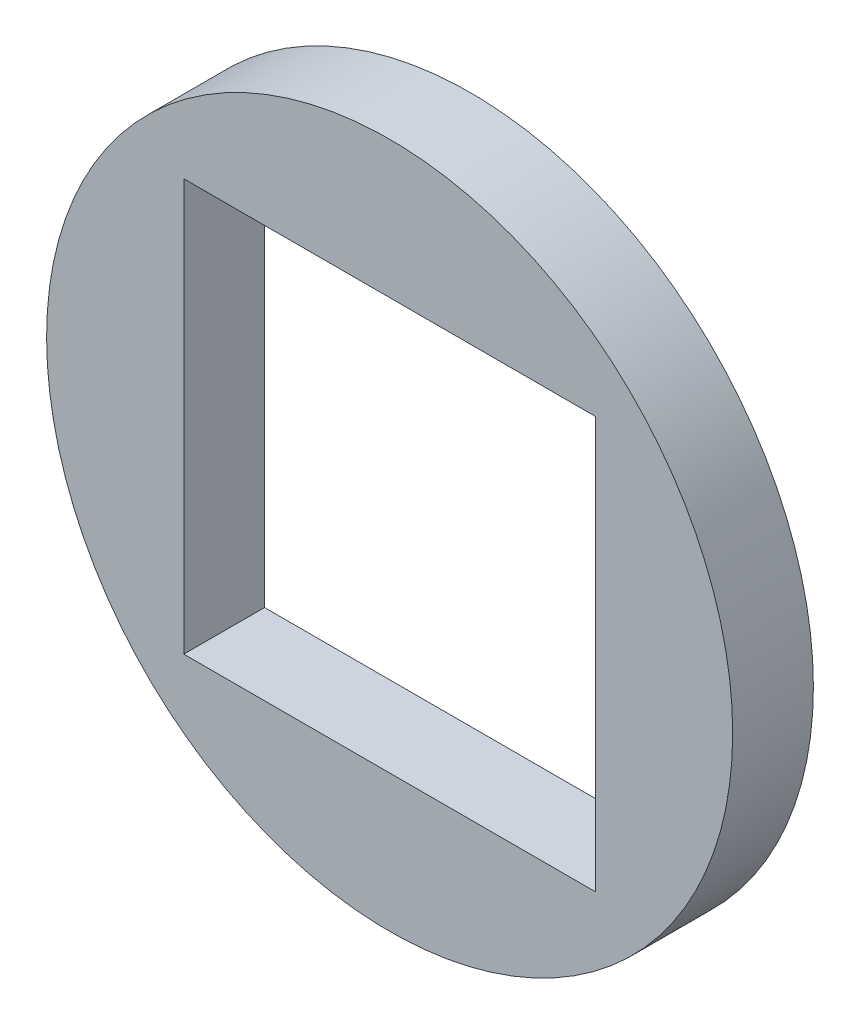
ISO-10303-21;
HEADER;
FILE_DESCRIPTION(('STEP AP214'),'2;1');
FILE_NAME('part.step','',(''),(''),'','','');
FILE_SCHEMA(('AUTOMOTIVE_DESIGN { 1 0 10303 214 1 1 1 1 }'));
ENDSEC;
DATA;
#1=APPLICATION_CONTEXT('core data for automotive mechanical design processes');
#2=APPLICATION_PROTOCOL_DEFINITION('international standard','automotive_design',2000,#1);
#3=PRODUCT_CONTEXT('',#1,'mechanical');
#4=PRODUCT('Part','Part','',(#3));
#5=PRODUCT_RELATED_PRODUCT_CATEGORY('part','',(#4));
#6=PRODUCT_DEFINITION_FORMATION('','',#4);
#7=PRODUCT_DEFINITION_CONTEXT('part definition',#1,'design');
#8=PRODUCT_DEFINITION('design','',#6,#7);
#9=PRODUCT_DEFINITION_SHAPE('','',#8);
#10=(LENGTH_UNIT() NAMED_UNIT(*) SI_UNIT(.MILLI.,.METRE.));
#11=(NAMED_UNIT(*) PLANE_ANGLE_UNIT() SI_UNIT($,.RADIAN.));
#12=(NAMED_UNIT(*) SI_UNIT($,.STERADIAN.) SOLID_ANGLE_UNIT());
#13=UNCERTAINTY_MEASURE_WITH_UNIT(LENGTH_MEASURE(1.E-05),#10,'distance_accuracy_value','');
#14=(GEOMETRIC_REPRESENTATION_CONTEXT(3) GLOBAL_UNCERTAINTY_ASSIGNED_CONTEXT((#13)) GLOBAL_UNIT_ASSIGNED_CONTEXT((#10,
#11,#12)) REPRESENTATION_CONTEXT('',''));
#15=CARTESIAN_POINT('',(0.,0.,0.));
#16=DIRECTION('',(0.,0.,1.));
#17=DIRECTION('',(1.,0.,0.));
#18=AXIS2_PLACEMENT_3D('',#15,#16,#17);
#19=CARTESIAN_POINT('',(0.,0.,2.));
#20=DIRECTION('',(0.,0.,1.));
#21=DIRECTION('',(1.,0.,0.));
#22=AXIS2_PLACEMENT_3D('',#19,#20,#21);
#23=PLANE('',#22);
#24=CARTESIAN_POINT('',(0.,0.,2.));
#25=DIRECTION('',(0.,0.,1.));
#26=DIRECTION('',(1.,0.,0.));
#27=AXIS2_PLACEMENT_3D('',#24,#25,#26);
#28=CIRCLE('',#27,8.5);
#29=CARTESIAN_POINT('',(8.5,0.,2.));
#30=VERTEX_POINT('',#29);
#31=EDGE_CURVE('E11',#30,#30,#28,.T.);
#32=ORIENTED_EDGE('',*,*,#31,.T.);
#33=EDGE_LOOP('',(#32));
#34=FACE_BOUND('',#33,.T.);
#35=DIRECTION('',(-1.,0.,0.));
#36=VECTOR('',#35,1.);
#37=CARTESIAN_POINT('',(-5.1,5.1,2.));
#38=LINE('',#37,#36);
#39=CARTESIAN_POINT('',(5.1,5.1,2.));
#40=VERTEX_POINT('',#39);
#41=CARTESIAN_POINT('',(-5.1,5.1,2.));
#42=VERTEX_POINT('',#41);
#43=EDGE_CURVE('E81',#40,#42,#38,.T.);
#44=ORIENTED_EDGE('',*,*,#43,.F.);
#45=DIRECTION('',(0.,1.,0.));
#46=VECTOR('',#45,1.);
#47=CARTESIAN_POINT('',(5.1,-5.1,2.));
#48=LINE('',#47,#46);
#49=CARTESIAN_POINT('',(5.1,-5.1,2.));
#50=VERTEX_POINT('',#49);
#51=EDGE_CURVE('E73',#50,#40,#48,.T.);
#52=ORIENTED_EDGE('',*,*,#51,.F.);
#53=DIRECTION('',(1.,0.,0.));
#54=VECTOR('',#53,1.);
#55=CARTESIAN_POINT('',(-5.1,-5.1,2.));
#56=LINE('',#55,#54);
#57=CARTESIAN_POINT('',(-5.1,-5.1,2.));
#58=VERTEX_POINT('',#57);
#59=EDGE_CURVE('E94',#58,#50,#56,.T.);
#60=ORIENTED_EDGE('',*,*,#59,.F.);
#61=DIRECTION('',(0.,-1.,0.));
#62=VECTOR('',#61,1.);
#63=CARTESIAN_POINT('',(-5.1,-5.1,2.));
#64=LINE('',#63,#62);
#65=EDGE_CURVE('E92',#42,#58,#64,.T.);
#66=ORIENTED_EDGE('',*,*,#65,.F.);
#67=EDGE_LOOP('',(#44,#52,#60,#66));
#68=FACE_BOUND('',#67,.T.);
#69=ADVANCED_FACE('F32',(#34,#68),#23,.T.);
#70=CARTESIAN_POINT('',(0.,0.,0.));
#71=DIRECTION('',(0.,0.,1.));
#72=DIRECTION('',(1.,0.,0.));
#73=AXIS2_PLACEMENT_3D('',#70,#71,#72);
#74=PLANE('',#73);
#75=CARTESIAN_POINT('',(0.,0.,0.));
#76=DIRECTION('',(0.,0.,1.));
#77=DIRECTION('',(1.,0.,0.));
#78=AXIS2_PLACEMENT_3D('',#75,#76,#77);
#79=CIRCLE('',#78,8.5);
#80=CARTESIAN_POINT('',(8.5,0.,0.));
#81=VERTEX_POINT('',#80);
#82=EDGE_CURVE('E36',#81,#81,#79,.T.);
#83=ORIENTED_EDGE('',*,*,#82,.F.);
#84=EDGE_LOOP('',(#83));
#85=FACE_BOUND('',#84,.T.);
#86=DIRECTION('',(0.,1.,0.));
#87=VECTOR('',#86,1.);
#88=CARTESIAN_POINT('',(5.1,-5.1,0.));
#89=LINE('',#88,#87);
#90=CARTESIAN_POINT('',(5.1,-5.1,0.));
#91=VERTEX_POINT('',#90);
#92=CARTESIAN_POINT('',(5.1,5.1,0.));
#93=VERTEX_POINT('',#92);
#94=EDGE_CURVE('E55',#91,#93,#89,.T.);
#95=ORIENTED_EDGE('',*,*,#94,.T.);
#96=DIRECTION('',(-1.,0.,0.));
#97=VECTOR('',#96,1.);
#98=CARTESIAN_POINT('',(-5.1,5.1,0.));
#99=LINE('',#98,#97);
#100=CARTESIAN_POINT('',(-5.1,5.1,0.));
#101=VERTEX_POINT('',#100);
#102=EDGE_CURVE('E88',#93,#101,#99,.T.);
#103=ORIENTED_EDGE('',*,*,#102,.T.);
#104=DIRECTION('',(0.,-1.,0.));
#105=VECTOR('',#104,1.);
#106=CARTESIAN_POINT('',(-5.1,-5.1,0.));
#107=LINE('',#106,#105);
#108=CARTESIAN_POINT('',(-5.1,-5.1,0.));
#109=VERTEX_POINT('',#108);
#110=EDGE_CURVE('E100',#101,#109,#107,.T.);
#111=ORIENTED_EDGE('',*,*,#110,.T.);
#112=DIRECTION('',(1.,0.,0.));
#113=VECTOR('',#112,1.);
#114=CARTESIAN_POINT('',(-5.1,-5.1,0.));
#115=LINE('',#114,#113);
#116=EDGE_CURVE('E82',#109,#91,#115,.T.);
#117=ORIENTED_EDGE('',*,*,#116,.T.);
#118=EDGE_LOOP('',(#95,#103,#111,#117));
#119=FACE_BOUND('',#118,.T.);
#120=ADVANCED_FACE('F111',(#85,#119),#74,.F.);
#121=CARTESIAN_POINT('',(0.,0.,2.));
#122=DIRECTION('',(0.,0.,-1.));
#123=DIRECTION('',(-1.,0.,0.));
#124=AXIS2_PLACEMENT_3D('',#121,#122,#123);
#125=CYLINDRICAL_SURFACE('',#124,8.5);
#126=ORIENTED_EDGE('',*,*,#31,.F.);
#127=EDGE_LOOP('',(#126));
#128=FACE_BOUND('',#127,.T.);
#129=ORIENTED_EDGE('',*,*,#82,.T.);
#130=EDGE_LOOP('',(#129));
#131=FACE_BOUND('',#130,.T.);
#132=ADVANCED_FACE('F34',(#128,#131),#125,.T.);
#133=CARTESIAN_POINT('',(5.1,-5.1,2.));
#134=DIRECTION('',(-1.,0.,0.));
#135=DIRECTION('',(0.,0.,1.));
#136=AXIS2_PLACEMENT_3D('',#133,#134,#135);
#137=PLANE('',#136);
#138=ORIENTED_EDGE('',*,*,#94,.F.);
#139=DIRECTION('',(0.,0.,-1.));
#140=VECTOR('',#139,1.);
#141=CARTESIAN_POINT('',(5.1,-5.1,2.));
#142=LINE('',#141,#140);
#143=EDGE_CURVE('E77',#50,#91,#142,.T.);
#144=ORIENTED_EDGE('',*,*,#143,.F.);
#145=ORIENTED_EDGE('',*,*,#51,.T.);
#146=DIRECTION('',(0.,0.,-1.));
#147=VECTOR('',#146,1.);
#148=CARTESIAN_POINT('',(5.1,5.1,2.));
#149=LINE('',#148,#147);
#150=EDGE_CURVE('E76',#40,#93,#149,.T.);
#151=ORIENTED_EDGE('',*,*,#150,.T.);
#152=EDGE_LOOP('',(#138,#144,#145,#151));
#153=FACE_BOUND('',#152,.T.);
#154=ADVANCED_FACE('F75',(#153),#137,.T.);
#155=CARTESIAN_POINT('',(-5.1,5.1,2.));
#156=DIRECTION('',(0.,-1.,0.));
#157=DIRECTION('',(0.,0.,-1.));
#158=AXIS2_PLACEMENT_3D('',#155,#156,#157);
#159=PLANE('',#158);
#160=ORIENTED_EDGE('',*,*,#102,.F.);
#161=ORIENTED_EDGE('',*,*,#150,.F.);
#162=ORIENTED_EDGE('',*,*,#43,.T.);
#163=DIRECTION('',(0.,0.,-1.));
#164=VECTOR('',#163,1.);
#165=CARTESIAN_POINT('',(-5.1,5.1,2.));
#166=LINE('',#165,#164);
#167=EDGE_CURVE('E89',#42,#101,#166,.T.);
#168=ORIENTED_EDGE('',*,*,#167,.T.);
#169=EDGE_LOOP('',(#160,#161,#162,#168));
#170=FACE_BOUND('',#169,.T.);
#171=ADVANCED_FACE('F85',(#170),#159,.T.);
#172=CARTESIAN_POINT('',(-5.1,-5.1,2.));
#173=DIRECTION('',(1.,0.,0.));
#174=DIRECTION('',(0.,0.,-1.));
#175=AXIS2_PLACEMENT_3D('',#172,#173,#174);
#176=PLANE('',#175);
#177=ORIENTED_EDGE('',*,*,#110,.F.);
#178=ORIENTED_EDGE('',*,*,#167,.F.);
#179=ORIENTED_EDGE('',*,*,#65,.T.);
#180=DIRECTION('',(0.,0.,-1.));
#181=VECTOR('',#180,1.);
#182=CARTESIAN_POINT('',(-5.1,-5.1,2.));
#183=LINE('',#182,#181);
#184=EDGE_CURVE('E47',#58,#109,#183,.T.);
#185=ORIENTED_EDGE('',*,*,#184,.T.);
#186=EDGE_LOOP('',(#177,#178,#179,#185));
#187=FACE_BOUND('',#186,.T.);
#188=ADVANCED_FACE('F109',(#187),#176,.T.);
#189=CARTESIAN_POINT('',(-5.1,-5.1,2.));
#190=DIRECTION('',(0.,1.,0.));
#191=DIRECTION('',(0.,0.,1.));
#192=AXIS2_PLACEMENT_3D('',#189,#190,#191);
#193=PLANE('',#192);
#194=ORIENTED_EDGE('',*,*,#116,.F.);
#195=ORIENTED_EDGE('',*,*,#184,.F.);
#196=ORIENTED_EDGE('',*,*,#59,.T.);
#197=ORIENTED_EDGE('',*,*,#143,.T.);
#198=EDGE_LOOP('',(#194,#195,#196,#197));
#199=FACE_BOUND('',#198,.T.);
#200=ADVANCED_FACE('F112',(#199),#193,.T.);
#201=CLOSED_SHELL('',(#69,#120,#132,#154,#171,#188,#200));
#202=MANIFOLD_SOLID_BREP('B2',#201);
#203=ADVANCED_BREP_SHAPE_REPRESENTATION('',(#18,#202),#14);
#204=SHAPE_DEFINITION_REPRESENTATION(#9,#203);
ENDSEC;
END-ISO-10303-21;
